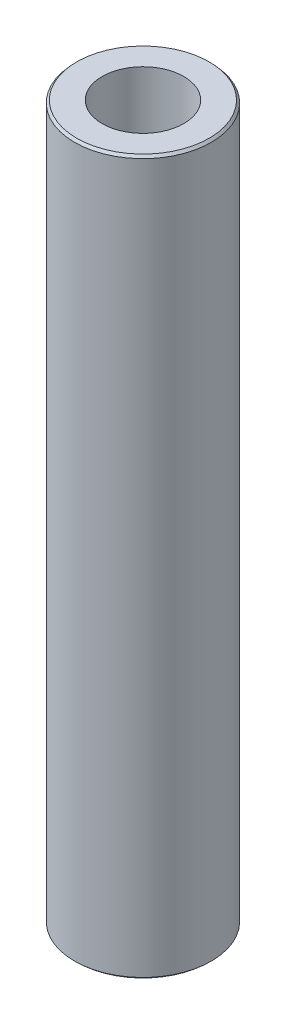
ISO-10303-21;
HEADER;
FILE_DESCRIPTION(('STEP AP214'),'2;1');
FILE_NAME('part.step','',(''),(''),'','','');
FILE_SCHEMA(('AUTOMOTIVE_DESIGN { 1 0 10303 214 1 1 1 1 }'));
ENDSEC;
DATA;
#1=APPLICATION_CONTEXT('core data for automotive mechanical design processes');
#2=APPLICATION_PROTOCOL_DEFINITION('international standard','automotive_design',2000,#1);
#3=PRODUCT_CONTEXT('',#1,'mechanical');
#4=PRODUCT('Part','Part','',(#3));
#5=PRODUCT_RELATED_PRODUCT_CATEGORY('part','',(#4));
#6=PRODUCT_DEFINITION_FORMATION('','',#4);
#7=PRODUCT_DEFINITION_CONTEXT('part definition',#1,'design');
#8=PRODUCT_DEFINITION('design','',#6,#7);
#9=PRODUCT_DEFINITION_SHAPE('','',#8);
#10=(LENGTH_UNIT() NAMED_UNIT(*) SI_UNIT(.MILLI.,.METRE.));
#11=(NAMED_UNIT(*) PLANE_ANGLE_UNIT() SI_UNIT($,.RADIAN.));
#12=(NAMED_UNIT(*) SI_UNIT($,.STERADIAN.) SOLID_ANGLE_UNIT());
#13=UNCERTAINTY_MEASURE_WITH_UNIT(LENGTH_MEASURE(1.E-05),#10,'distance_accuracy_value','');
#14=(GEOMETRIC_REPRESENTATION_CONTEXT(3) GLOBAL_UNCERTAINTY_ASSIGNED_CONTEXT((#13)) GLOBAL_UNIT_ASSIGNED_CONTEXT((#10,
#11,#12)) REPRESENTATION_CONTEXT('',''));
#15=CARTESIAN_POINT('',(0.,0.,0.));
#16=DIRECTION('',(0.,0.,1.));
#17=DIRECTION('',(1.,0.,0.));
#18=AXIS2_PLACEMENT_3D('',#15,#16,#17);
#19=CARTESIAN_POINT('',(0.,600.,0.));
#20=DIRECTION('',(0.,-1.,0.));
#21=DIRECTION('',(0.,0.,-1.));
#22=AXIS2_PLACEMENT_3D('',#19,#20,#21);
#23=CYLINDRICAL_SURFACE('',#22,57.5);
#24=CARTESIAN_POINT('',(0.,597.959671846701,0.));
#25=DIRECTION('',(0.,1.,0.));
#26=DIRECTION('',(0.,0.,1.));
#27=AXIS2_PLACEMENT_3D('',#24,#25,#26);
#28=CIRCLE('',#27,57.5);
#29=CARTESIAN_POINT('',(0.,597.959671846701,57.5));
#30=VERTEX_POINT('',#29);
#31=EDGE_CURVE('E50',#30,#30,#28,.F.);
#32=ORIENTED_EDGE('',*,*,#31,.T.);
#33=EDGE_LOOP('',(#32));
#34=FACE_BOUND('',#33,.T.);
#35=CARTESIAN_POINT('',(0.,1.8454333727741,0.));
#36=DIRECTION('',(0.,1.,0.));
#37=DIRECTION('',(0.,0.,1.));
#38=AXIS2_PLACEMENT_3D('',#35,#36,#37);
#39=CIRCLE('',#38,57.5);
#40=CARTESIAN_POINT('',(0.,1.8454333727741,57.5));
#41=VERTEX_POINT('',#40);
#42=EDGE_CURVE('E51',#41,#41,#39,.T.);
#43=ORIENTED_EDGE('',*,*,#42,.T.);
#44=EDGE_LOOP('',(#43));
#45=FACE_BOUND('',#44,.T.);
#46=ADVANCED_FACE('F39',(#34,#45),#23,.T.);
#47=CARTESIAN_POINT('',(0.,600.,0.));
#48=DIRECTION('',(0.,1.,0.));
#49=DIRECTION('',(0.,0.,1.));
#50=AXIS2_PLACEMENT_3D('',#47,#48,#49);
#51=PLANE('',#50);
#52=CARTESIAN_POINT('',(0.,600.,0.));
#53=DIRECTION('',(0.,1.,0.));
#54=DIRECTION('',(0.,0.,1.));
#55=AXIS2_PLACEMENT_3D('',#52,#53,#54);
#56=CIRCLE('',#55,55.6545666272259);
#57=CARTESIAN_POINT('',(0.,600.,55.6545666272259));
#58=VERTEX_POINT('',#57);
#59=EDGE_CURVE('E54',#58,#58,#56,.T.);
#60=ORIENTED_EDGE('',*,*,#59,.T.);
#61=EDGE_LOOP('',(#60));
#62=FACE_BOUND('',#61,.T.);
#63=CARTESIAN_POINT('',(0.,600.,0.));
#64=DIRECTION('',(0.,1.,0.));
#65=DIRECTION('',(0.,0.,1.));
#66=AXIS2_PLACEMENT_3D('',#63,#64,#65);
#67=CIRCLE('',#66,34.3366917989911);
#68=CARTESIAN_POINT('',(0.,600.,34.3366917989911));
#69=VERTEX_POINT('',#68);
#70=EDGE_CURVE('E58',#69,#69,#67,.T.);
#71=ORIENTED_EDGE('',*,*,#70,.F.);
#72=EDGE_LOOP('',(#71));
#73=FACE_BOUND('',#72,.T.);
#74=ADVANCED_FACE('F69',(#62,#73),#51,.T.);
#75=CARTESIAN_POINT('',(0.,0.,0.));
#76=DIRECTION('',(0.,1.,0.));
#77=DIRECTION('',(0.,0.,1.));
#78=AXIS2_PLACEMENT_3D('',#75,#76,#77);
#79=PLANE('',#78);
#80=CARTESIAN_POINT('',(0.,0.,0.));
#81=DIRECTION('',(0.,1.,0.));
#82=DIRECTION('',(0.,0.,1.));
#83=AXIS2_PLACEMENT_3D('',#80,#81,#82);
#84=CIRCLE('',#83,55.459671846701);
#85=CARTESIAN_POINT('',(0.,0.,55.459671846701));
#86=VERTEX_POINT('',#85);
#87=EDGE_CURVE('E10',#86,#86,#84,.F.);
#88=ORIENTED_EDGE('',*,*,#87,.T.);
#89=EDGE_LOOP('',(#88));
#90=FACE_BOUND('',#89,.T.);
#91=CARTESIAN_POINT('',(0.,0.,0.));
#92=DIRECTION('',(0.,1.,0.));
#93=DIRECTION('',(0.,0.,1.));
#94=AXIS2_PLACEMENT_3D('',#91,#92,#93);
#95=CIRCLE('',#94,34.3366917989911);
#96=CARTESIAN_POINT('',(0.,0.,34.3366917989911));
#97=VERTEX_POINT('',#96);
#98=EDGE_CURVE('E63',#97,#97,#95,.T.);
#99=ORIENTED_EDGE('',*,*,#98,.T.);
#100=EDGE_LOOP('',(#99));
#101=FACE_BOUND('',#100,.T.);
#102=ADVANCED_FACE('F75',(#90,#101),#79,.F.);
#103=CARTESIAN_POINT('',(0.,600.,0.));
#104=DIRECTION('',(0.,-1.,0.));
#105=DIRECTION('',(0.,0.,-1.));
#106=AXIS2_PLACEMENT_3D('',#103,#104,#105);
#107=CYLINDRICAL_SURFACE('',#106,34.3366917989911);
#108=ORIENTED_EDGE('',*,*,#70,.T.);
#109=EDGE_LOOP('',(#108));
#110=FACE_BOUND('',#109,.T.);
#111=ORIENTED_EDGE('',*,*,#98,.F.);
#112=EDGE_LOOP('',(#111));
#113=FACE_BOUND('',#112,.T.);
#114=ADVANCED_FACE('F70',(#110,#113),#107,.F.);
#115=CARTESIAN_POINT('',(0.,600.,0.));
#116=DIRECTION('',(0.,-1.,0.));
#117=DIRECTION('',(0.,0.,-1.));
#118=AXIS2_PLACEMENT_3D('',#115,#116,#117);
#119=CONICAL_SURFACE('',#118,55.6545666272259,0.735284023036666);
#120=ORIENTED_EDGE('',*,*,#31,.F.);
#121=EDGE_LOOP('',(#120));
#122=FACE_BOUND('',#121,.T.);
#123=ORIENTED_EDGE('',*,*,#59,.F.);
#124=EDGE_LOOP('',(#123));
#125=FACE_BOUND('',#124,.T.);
#126=ADVANCED_FACE('F81',(#122,#125),#119,.T.);
#127=CARTESIAN_POINT('',(0.,1.8454333727741,0.));
#128=DIRECTION('',(0.,1.,0.));
#129=DIRECTION('',(0.,0.,1.));
#130=AXIS2_PLACEMENT_3D('',#127,#128,#129);
#131=CONICAL_SURFACE('',#130,57.5,0.835512303758221);
#132=ORIENTED_EDGE('',*,*,#87,.F.);
#133=EDGE_LOOP('',(#132));
#134=FACE_BOUND('',#133,.T.);
#135=ORIENTED_EDGE('',*,*,#42,.F.);
#136=EDGE_LOOP('',(#135));
#137=FACE_BOUND('',#136,.T.);
#138=ADVANCED_FACE('F45',(#134,#137),#131,.T.);
#139=CLOSED_SHELL('',(#46,#74,#102,#114,#126,#138));
#140=MANIFOLD_SOLID_BREP('B2',#139);
#141=ADVANCED_BREP_SHAPE_REPRESENTATION('',(#18,#140),#14);
#142=SHAPE_DEFINITION_REPRESENTATION(#9,#141);
ENDSEC;
END-ISO-10303-21;
